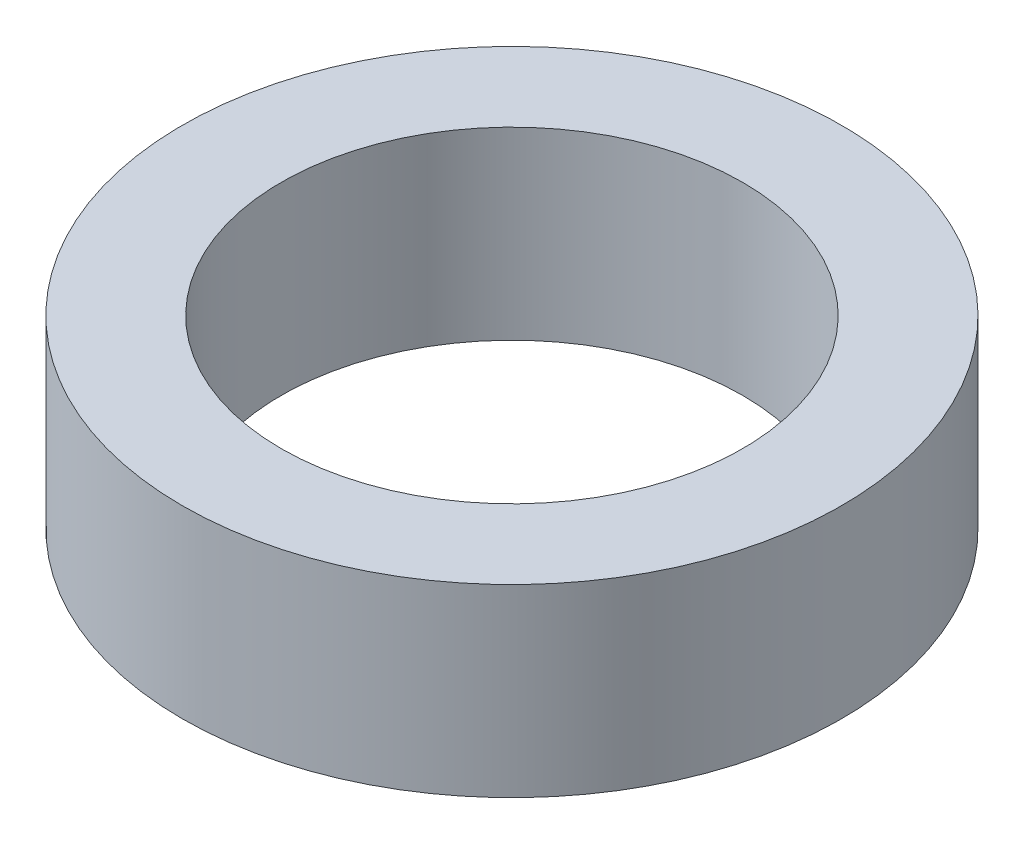
ISO-10303-21;
HEADER;
FILE_DESCRIPTION(('STEP AP214'),'2;1');
FILE_NAME('part.step','',(''),(''),'','','');
FILE_SCHEMA(('AUTOMOTIVE_DESIGN { 1 0 10303 214 1 1 1 1 }'));
ENDSEC;
DATA;
#1=APPLICATION_CONTEXT('core data for automotive mechanical design processes');
#2=APPLICATION_PROTOCOL_DEFINITION('international standard','automotive_design',2000,#1);
#3=PRODUCT_CONTEXT('',#1,'mechanical');
#4=PRODUCT('Part','Part','',(#3));
#5=PRODUCT_RELATED_PRODUCT_CATEGORY('part','',(#4));
#6=PRODUCT_DEFINITION_FORMATION('','',#4);
#7=PRODUCT_DEFINITION_CONTEXT('part definition',#1,'design');
#8=PRODUCT_DEFINITION('design','',#6,#7);
#9=PRODUCT_DEFINITION_SHAPE('','',#8);
#10=(LENGTH_UNIT() NAMED_UNIT(*) SI_UNIT(.MILLI.,.METRE.));
#11=(NAMED_UNIT(*) PLANE_ANGLE_UNIT() SI_UNIT($,.RADIAN.));
#12=(NAMED_UNIT(*) SI_UNIT($,.STERADIAN.) SOLID_ANGLE_UNIT());
#13=UNCERTAINTY_MEASURE_WITH_UNIT(LENGTH_MEASURE(1.E-05),#10,'distance_accuracy_value','');
#14=(GEOMETRIC_REPRESENTATION_CONTEXT(3) GLOBAL_UNCERTAINTY_ASSIGNED_CONTEXT((#13)) GLOBAL_UNIT_ASSIGNED_CONTEXT((#10,
#11,#12)) REPRESENTATION_CONTEXT('',''));
#15=CARTESIAN_POINT('',(0.,0.,0.));
#16=DIRECTION('',(0.,0.,1.));
#17=DIRECTION('',(1.,0.,0.));
#18=AXIS2_PLACEMENT_3D('',#15,#16,#17);
#19=CARTESIAN_POINT('',(0.,7.112,0.));
#20=DIRECTION('',(0.,1.,0.));
#21=DIRECTION('',(0.,0.,1.));
#22=AXIS2_PLACEMENT_3D('',#19,#20,#21);
#23=PLANE('',#22);
#24=CARTESIAN_POINT('',(0.,7.112,0.));
#25=DIRECTION('',(0.,1.,0.));
#26=DIRECTION('',(0.,0.,1.));
#27=AXIS2_PLACEMENT_3D('',#24,#25,#26);
#28=CIRCLE('',#27,12.7);
#29=CARTESIAN_POINT('',(0.,7.112,12.7));
#30=VERTEX_POINT('',#29);
#31=EDGE_CURVE('E10',#30,#30,#28,.T.);
#32=ORIENTED_EDGE('',*,*,#31,.T.);
#33=EDGE_LOOP('',(#32));
#34=FACE_BOUND('',#33,.T.);
#35=CARTESIAN_POINT('',(0.,7.112,0.));
#36=DIRECTION('',(0.,1.,0.));
#37=DIRECTION('',(0.,0.,1.));
#38=AXIS2_PLACEMENT_3D('',#35,#36,#37);
#39=CIRCLE('',#38,8.89);
#40=CARTESIAN_POINT('',(0.,7.112,8.89));
#41=VERTEX_POINT('',#40);
#42=EDGE_CURVE('E54',#41,#41,#39,.T.);
#43=ORIENTED_EDGE('',*,*,#42,.F.);
#44=EDGE_LOOP('',(#43));
#45=FACE_BOUND('',#44,.T.);
#46=ADVANCED_FACE('F41',(#34,#45),#23,.T.);
#47=CARTESIAN_POINT('',(0.,0.,0.));
#48=DIRECTION('',(0.,1.,0.));
#49=DIRECTION('',(0.,0.,1.));
#50=AXIS2_PLACEMENT_3D('',#47,#48,#49);
#51=PLANE('',#50);
#52=CARTESIAN_POINT('',(0.,0.,0.));
#53=DIRECTION('',(0.,1.,0.));
#54=DIRECTION('',(0.,0.,1.));
#55=AXIS2_PLACEMENT_3D('',#52,#53,#54);
#56=CIRCLE('',#55,12.7);
#57=CARTESIAN_POINT('',(0.,0.,12.7));
#58=VERTEX_POINT('',#57);
#59=EDGE_CURVE('E45',#58,#58,#56,.T.);
#60=ORIENTED_EDGE('',*,*,#59,.F.);
#61=EDGE_LOOP('',(#60));
#62=FACE_BOUND('',#61,.T.);
#63=CARTESIAN_POINT('',(0.,0.,0.));
#64=DIRECTION('',(0.,1.,0.));
#65=DIRECTION('',(0.,0.,1.));
#66=AXIS2_PLACEMENT_3D('',#63,#64,#65);
#67=CIRCLE('',#66,8.89);
#68=CARTESIAN_POINT('',(0.,0.,8.89));
#69=VERTEX_POINT('',#68);
#70=EDGE_CURVE('E56',#69,#69,#67,.T.);
#71=ORIENTED_EDGE('',*,*,#70,.T.);
#72=EDGE_LOOP('',(#71));
#73=FACE_BOUND('',#72,.T.);
#74=ADVANCED_FACE('F68',(#62,#73),#51,.F.);
#75=CARTESIAN_POINT('',(0.,7.112,0.));
#76=DIRECTION('',(0.,-1.,0.));
#77=DIRECTION('',(0.,0.,-1.));
#78=AXIS2_PLACEMENT_3D('',#75,#76,#77);
#79=CYLINDRICAL_SURFACE('',#78,12.7);
#80=ORIENTED_EDGE('',*,*,#31,.F.);
#81=EDGE_LOOP('',(#80));
#82=FACE_BOUND('',#81,.T.);
#83=ORIENTED_EDGE('',*,*,#59,.T.);
#84=EDGE_LOOP('',(#83));
#85=FACE_BOUND('',#84,.T.);
#86=ADVANCED_FACE('F43',(#82,#85),#79,.T.);
#87=CARTESIAN_POINT('',(0.,7.112,0.));
#88=DIRECTION('',(0.,-1.,0.));
#89=DIRECTION('',(0.,0.,-1.));
#90=AXIS2_PLACEMENT_3D('',#87,#88,#89);
#91=CYLINDRICAL_SURFACE('',#90,8.89);
#92=ORIENTED_EDGE('',*,*,#42,.T.);
#93=EDGE_LOOP('',(#92));
#94=FACE_BOUND('',#93,.T.);
#95=ORIENTED_EDGE('',*,*,#70,.F.);
#96=EDGE_LOOP('',(#95));
#97=FACE_BOUND('',#96,.T.);
#98=ADVANCED_FACE('F64',(#94,#97),#91,.F.);
#99=CLOSED_SHELL('',(#46,#74,#86,#98));
#100=MANIFOLD_SOLID_BREP('B2',#99);
#101=ADVANCED_BREP_SHAPE_REPRESENTATION('',(#18,#100),#14);
#102=SHAPE_DEFINITION_REPRESENTATION(#9,#101);
ENDSEC;
END-ISO-10303-21;
